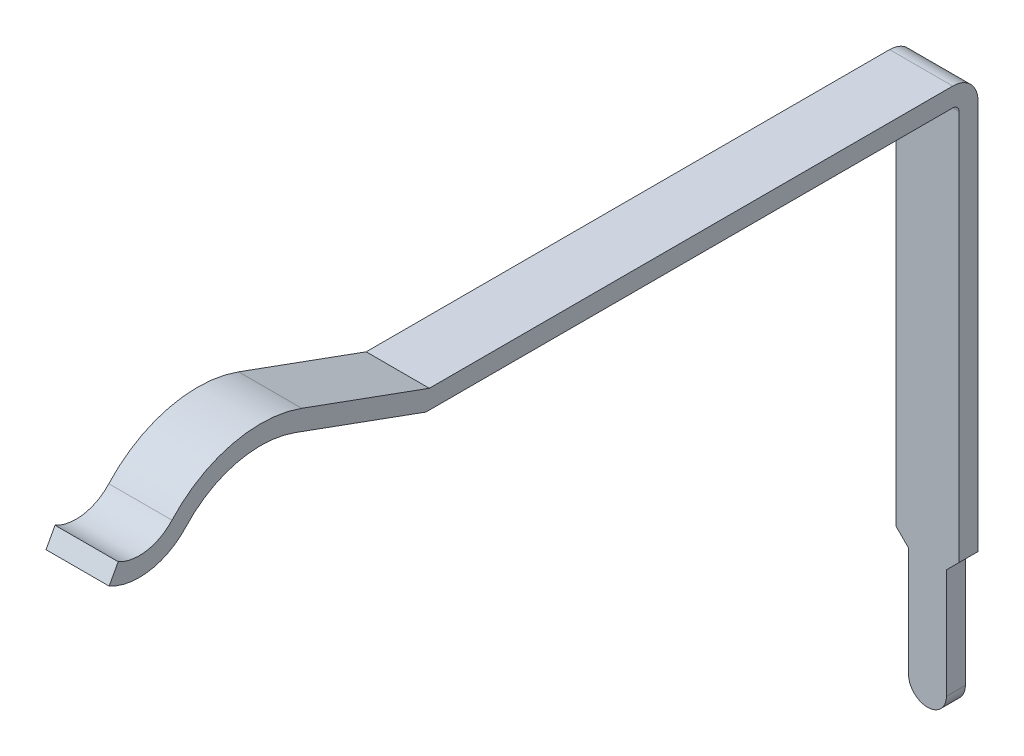
ISO-10303-21;
HEADER;
FILE_DESCRIPTION(('STEP AP214'),'2;1');
FILE_NAME('part.step','',(''),(''),'','','');
FILE_SCHEMA(('AUTOMOTIVE_DESIGN { 1 0 10303 214 1 1 1 1 }'));
ENDSEC;
DATA;
#1=APPLICATION_CONTEXT('core data for automotive mechanical design processes');
#2=APPLICATION_PROTOCOL_DEFINITION('international standard','automotive_design',2000,#1);
#3=PRODUCT_CONTEXT('',#1,'mechanical');
#4=PRODUCT('Part','Part','',(#3));
#5=PRODUCT_RELATED_PRODUCT_CATEGORY('part','',(#4));
#6=PRODUCT_DEFINITION_FORMATION('','',#4);
#7=PRODUCT_DEFINITION_CONTEXT('part definition',#1,'design');
#8=PRODUCT_DEFINITION('design','',#6,#7);
#9=PRODUCT_DEFINITION_SHAPE('','',#8);
#10=(LENGTH_UNIT() NAMED_UNIT(*) SI_UNIT(.MILLI.,.METRE.));
#11=(NAMED_UNIT(*) PLANE_ANGLE_UNIT() SI_UNIT($,.RADIAN.));
#12=(NAMED_UNIT(*) SI_UNIT($,.STERADIAN.) SOLID_ANGLE_UNIT());
#13=UNCERTAINTY_MEASURE_WITH_UNIT(LENGTH_MEASURE(1.E-05),#10,'distance_accuracy_value','');
#14=(GEOMETRIC_REPRESENTATION_CONTEXT(3) GLOBAL_UNCERTAINTY_ASSIGNED_CONTEXT((#13)) GLOBAL_UNIT_ASSIGNED_CONTEXT((#10,
#11,#12)) REPRESENTATION_CONTEXT('',''));
#15=CARTESIAN_POINT('',(0.,0.,0.));
#16=DIRECTION('',(0.,0.,1.));
#17=DIRECTION('',(1.,0.,0.));
#18=AXIS2_PLACEMENT_3D('',#15,#16,#17);
#19=CARTESIAN_POINT('',(0.5,-0.1,-14.46));
#20=DIRECTION('',(0.,0.,-1.));
#21=DIRECTION('',(-1.,0.,0.));
#22=AXIS2_PLACEMENT_3D('',#19,#20,#21);
#23=PLANE('',#22);
#24=DIRECTION('',(0.,1.,0.));
#25=VECTOR('',#24,1.);
#26=CARTESIAN_POINT('',(0.3,-0.1,-14.46));
#27=LINE('',#26,#25);
#28=CARTESIAN_POINT('',(0.3,-8.22,-14.46));
#29=VERTEX_POINT('',#28);
#30=CARTESIAN_POINT('',(0.3,-6.48526500902805,-14.46));
#31=VERTEX_POINT('',#30);
#32=EDGE_CURVE('E276',#29,#31,#27,.T.);
#33=ORIENTED_EDGE('',*,*,#32,.T.);
#34=DIRECTION('',(0.707106781186563,0.707106781186532,0.));
#35=VECTOR('',#34,1.);
#36=CARTESIAN_POINT('',(3.59263250451403,-3.19263250451416,-14.46));
#37=LINE('',#36,#35);
#38=CARTESIAN_POINT('',(0.5,-6.28526500902806,-14.46));
#39=VERTEX_POINT('',#38);
#40=EDGE_CURVE('E271',#31,#39,#37,.T.);
#41=ORIENTED_EDGE('',*,*,#40,.T.);
#42=DIRECTION('',(0.,-1.,0.));
#43=VECTOR('',#42,1.);
#44=CARTESIAN_POINT('',(0.5,-0.1,-14.46));
#45=LINE('',#44,#43);
#46=CARTESIAN_POINT('',(0.5,-0.1,-14.46));
#47=VERTEX_POINT('',#46);
#48=EDGE_CURVE('E199',#47,#39,#45,.T.);
#49=ORIENTED_EDGE('',*,*,#48,.F.);
#50=DIRECTION('',(-1.,0.,0.));
#51=VECTOR('',#50,1.);
#52=CARTESIAN_POINT('',(0.5,-0.1,-14.46));
#53=LINE('',#52,#51);
#54=CARTESIAN_POINT('',(-0.5,-0.1,-14.46));
#55=VERTEX_POINT('',#54);
#56=EDGE_CURVE('E162',#47,#55,#53,.T.);
#57=ORIENTED_EDGE('',*,*,#56,.T.);
#58=DIRECTION('',(0.,-1.,0.));
#59=VECTOR('',#58,1.);
#60=CARTESIAN_POINT('',(-0.5,-0.1,-14.46));
#61=LINE('',#60,#59);
#62=CARTESIAN_POINT('',(-0.5,-6.28526500902805,-14.46));
#63=VERTEX_POINT('',#62);
#64=EDGE_CURVE('E166',#55,#63,#61,.T.);
#65=ORIENTED_EDGE('',*,*,#64,.T.);
#66=DIRECTION('',(0.707106781186542,-0.707106781186553,0.));
#67=VECTOR('',#66,1.);
#68=CARTESIAN_POINT('',(-3.09263250451403,-3.69263250451398,-14.46));
#69=LINE('',#68,#67);
#70=CARTESIAN_POINT('',(-0.3,-6.48526500902805,-14.46));
#71=VERTEX_POINT('',#70);
#72=EDGE_CURVE('E48',#63,#71,#69,.T.);
#73=ORIENTED_EDGE('',*,*,#72,.T.);
#74=DIRECTION('',(0.,-1.,0.));
#75=VECTOR('',#74,1.);
#76=CARTESIAN_POINT('',(-0.3,-0.1,-14.46));
#77=LINE('',#76,#75);
#78=CARTESIAN_POINT('',(-0.3,-8.22,-14.46));
#79=VERTEX_POINT('',#78);
#80=EDGE_CURVE('E278',#71,#79,#77,.T.);
#81=ORIENTED_EDGE('',*,*,#80,.T.);
#82=CARTESIAN_POINT('',(0.,-8.22,-14.46));
#83=DIRECTION('',(0.,0.,-1.));
#84=DIRECTION('',(-1.,0.,0.));
#85=AXIS2_PLACEMENT_3D('',#82,#83,#84);
#86=CIRCLE('',#85,0.3);
#87=EDGE_CURVE('E170',#79,#29,#86,.F.);
#88=ORIENTED_EDGE('',*,*,#87,.T.);
#89=EDGE_LOOP('',(#33,#41,#49,#57,#65,#73,#81,#88));
#90=FACE_BOUND('',#89,.T.);
#91=ADVANCED_FACE('F34',(#90),#23,.F.);
#92=CARTESIAN_POINT('',(0.5,-0.1,-14.76));
#93=DIRECTION('',(0.,0.,-1.));
#94=DIRECTION('',(-1.,0.,0.));
#95=AXIS2_PLACEMENT_3D('',#92,#93,#94);
#96=PLANE('',#95);
#97=DIRECTION('',(-0.707106781186563,-0.707106781186532,0.));
#98=VECTOR('',#97,1.);
#99=CARTESIAN_POINT('',(0.5,-6.28526500902806,-14.76));
#100=LINE('',#99,#98);
#101=CARTESIAN_POINT('',(0.5,-6.28526500902806,-14.76));
#102=VERTEX_POINT('',#101);
#103=CARTESIAN_POINT('',(0.3,-6.48526500902805,-14.76));
#104=VERTEX_POINT('',#103);
#105=EDGE_CURVE('E302',#102,#104,#100,.T.);
#106=ORIENTED_EDGE('',*,*,#105,.T.);
#107=DIRECTION('',(0.,-1.,0.));
#108=VECTOR('',#107,1.);
#109=CARTESIAN_POINT('',(0.3,-6.48526500902805,-14.76));
#110=LINE('',#109,#108);
#111=CARTESIAN_POINT('',(0.3,-8.22,-14.76));
#112=VERTEX_POINT('',#111);
#113=EDGE_CURVE('E288',#104,#112,#110,.T.);
#114=ORIENTED_EDGE('',*,*,#113,.T.);
#115=CARTESIAN_POINT('',(0.,-8.22,-14.76));
#116=DIRECTION('',(0.,0.,-1.));
#117=DIRECTION('',(1.,0.,0.));
#118=AXIS2_PLACEMENT_3D('',#115,#116,#117);
#119=CIRCLE('',#118,0.3);
#120=CARTESIAN_POINT('',(-0.3,-8.22,-14.76));
#121=VERTEX_POINT('',#120);
#122=EDGE_CURVE('E311',#112,#121,#119,.T.);
#123=ORIENTED_EDGE('',*,*,#122,.T.);
#124=DIRECTION('',(0.,1.,0.));
#125=VECTOR('',#124,1.);
#126=CARTESIAN_POINT('',(-0.3,-8.22,-14.76));
#127=LINE('',#126,#125);
#128=CARTESIAN_POINT('',(-0.3,-6.48526500902805,-14.76));
#129=VERTEX_POINT('',#128);
#130=EDGE_CURVE('E308',#121,#129,#127,.T.);
#131=ORIENTED_EDGE('',*,*,#130,.T.);
#132=DIRECTION('',(-0.707106781186542,0.707106781186553,0.));
#133=VECTOR('',#132,1.);
#134=CARTESIAN_POINT('',(-0.3,-6.48526500902805,-14.76));
#135=LINE('',#134,#133);
#136=CARTESIAN_POINT('',(-0.5,-6.28526500902805,-14.76));
#137=VERTEX_POINT('',#136);
#138=EDGE_CURVE('E305',#129,#137,#135,.T.);
#139=ORIENTED_EDGE('',*,*,#138,.T.);
#140=DIRECTION('',(0.,1.,0.));
#141=VECTOR('',#140,1.);
#142=CARTESIAN_POINT('',(-0.5,-0.1,-14.76));
#143=LINE('',#142,#141);
#144=CARTESIAN_POINT('',(-0.5,-0.1,-14.76));
#145=VERTEX_POINT('',#144);
#146=EDGE_CURVE('E169',#145,#137,#143,.F.);
#147=ORIENTED_EDGE('',*,*,#146,.F.);
#148=DIRECTION('',(-1.,0.,0.));
#149=VECTOR('',#148,1.);
#150=CARTESIAN_POINT('',(0.5,-0.1,-14.76));
#151=LINE('',#150,#149);
#152=CARTESIAN_POINT('',(0.5,-0.1,-14.76));
#153=VERTEX_POINT('',#152);
#154=EDGE_CURVE('E11',#153,#145,#151,.T.);
#155=ORIENTED_EDGE('',*,*,#154,.F.);
#156=DIRECTION('',(0.,1.,0.));
#157=VECTOR('',#156,1.);
#158=CARTESIAN_POINT('',(0.5,-0.1,-14.76));
#159=LINE('',#158,#157);
#160=EDGE_CURVE('E241',#153,#102,#159,.F.);
#161=ORIENTED_EDGE('',*,*,#160,.T.);
#162=EDGE_LOOP('',(#106,#114,#123,#131,#139,#147,#155,#161));
#163=FACE_BOUND('',#162,.T.);
#164=ADVANCED_FACE('F315',(#163),#96,.T.);
#165=CARTESIAN_POINT('',(0.5,-0.1,-14.36));
#166=DIRECTION('',(-1.,0.,0.));
#167=DIRECTION('',(0.,0.,1.));
#168=AXIS2_PLACEMENT_3D('',#165,#166,#167);
#169=CYLINDRICAL_SURFACE('',#168,0.4);
#170=CARTESIAN_POINT('',(-0.5,-0.1,-14.36));
#171=DIRECTION('',(1.,0.,0.));
#172=DIRECTION('',(0.,0.,-1.));
#173=AXIS2_PLACEMENT_3D('',#170,#171,#172);
#174=CIRCLE('',#173,0.4);
#175=CARTESIAN_POINT('',(-0.5,0.3,-14.36));
#176=VERTEX_POINT('',#175);
#177=EDGE_CURVE('E173',#176,#145,#174,.F.);
#178=ORIENTED_EDGE('',*,*,#177,.F.);
#179=DIRECTION('',(-1.,0.,0.));
#180=VECTOR('',#179,1.);
#181=CARTESIAN_POINT('',(0.5,0.3,-14.36));
#182=LINE('',#181,#180);
#183=CARTESIAN_POINT('',(0.5,0.3,-14.36));
#184=VERTEX_POINT('',#183);
#185=EDGE_CURVE('E41',#184,#176,#182,.T.);
#186=ORIENTED_EDGE('',*,*,#185,.F.);
#187=CARTESIAN_POINT('',(0.5,-0.1,-14.36));
#188=DIRECTION('',(1.,0.,0.));
#189=DIRECTION('',(0.,0.,-1.));
#190=AXIS2_PLACEMENT_3D('',#187,#188,#189);
#191=CIRCLE('',#190,0.4);
#192=EDGE_CURVE('E237',#184,#153,#191,.F.);
#193=ORIENTED_EDGE('',*,*,#192,.T.);
#194=ORIENTED_EDGE('',*,*,#154,.T.);
#195=EDGE_LOOP('',(#178,#186,#193,#194));
#196=FACE_BOUND('',#195,.T.);
#197=ADVANCED_FACE('F225',(#196),#169,.T.);
#198=CARTESIAN_POINT('',(0.5,0.3,-6.01747897567001));
#199=DIRECTION('',(0.,1.,0.));
#200=DIRECTION('',(0.,0.,1.));
#201=AXIS2_PLACEMENT_3D('',#198,#199,#200);
#202=PLANE('',#201);
#203=DIRECTION('',(0.,0.,-1.));
#204=VECTOR('',#203,1.);
#205=CARTESIAN_POINT('',(-0.5,0.3,-6.01747897567001));
#206=LINE('',#205,#204);
#207=CARTESIAN_POINT('',(-0.5,0.3,-6.07037706988255));
#208=VERTEX_POINT('',#207);
#209=EDGE_CURVE('E176',#208,#176,#206,.T.);
#210=ORIENTED_EDGE('',*,*,#209,.F.);
#211=DIRECTION('',(-1.,0.,0.));
#212=VECTOR('',#211,1.);
#213=CARTESIAN_POINT('',(0.5,0.3,-6.07037706988255));
#214=LINE('',#213,#212);
#215=CARTESIAN_POINT('',(0.5,0.3,-6.07037706988255));
#216=VERTEX_POINT('',#215);
#217=EDGE_CURVE('E214',#216,#208,#214,.T.);
#218=ORIENTED_EDGE('',*,*,#217,.F.);
#219=DIRECTION('',(0.,0.,-1.));
#220=VECTOR('',#219,1.);
#221=CARTESIAN_POINT('',(0.5,0.3,-6.01747897567001));
#222=LINE('',#221,#220);
#223=EDGE_CURVE('E221',#216,#184,#222,.T.);
#224=ORIENTED_EDGE('',*,*,#223,.T.);
#225=ORIENTED_EDGE('',*,*,#185,.T.);
#226=EDGE_LOOP('',(#210,#218,#224,#225));
#227=FACE_BOUND('',#226,.T.);
#228=ADVANCED_FACE('F219',(#227),#202,.T.);
#229=CARTESIAN_POINT('',(0.5,1.03541597949323,-4.04983827231876));
#230=DIRECTION('',(0.,0.93969262078591,-0.342020143325664));
#231=DIRECTION('',(0.,0.342020143325664,0.93969262078591));
#232=AXIS2_PLACEMENT_3D('',#229,#230,#231);
#233=PLANE('',#232);
#234=DIRECTION('',(0.,-0.342020143325664,-0.93969262078591));
#235=VECTOR('',#234,1.);
#236=CARTESIAN_POINT('',(-0.5,1.03541597949323,-4.04983827231876));
#237=LINE('',#236,#235);
#238=CARTESIAN_POINT('',(-0.5,1.03541597949323,-4.04983827231876));
#239=VERTEX_POINT('',#238);
#240=EDGE_CURVE('E179',#239,#208,#237,.T.);
#241=ORIENTED_EDGE('',*,*,#240,.F.);
#242=DIRECTION('',(-1.,0.,0.));
#243=VECTOR('',#242,1.);
#244=CARTESIAN_POINT('',(0.5,1.03541597949323,-4.04983827231876));
#245=LINE('',#244,#243);
#246=CARTESIAN_POINT('',(0.5,1.03541597949323,-4.04983827231876));
#247=VERTEX_POINT('',#246);
#248=EDGE_CURVE('E212',#247,#239,#245,.T.);
#249=ORIENTED_EDGE('',*,*,#248,.F.);
#250=DIRECTION('',(0.,-0.342020143325664,-0.93969262078591));
#251=VECTOR('',#250,1.);
#252=CARTESIAN_POINT('',(0.5,1.03541597949323,-4.04983827231876));
#253=LINE('',#252,#251);
#254=EDGE_CURVE('E234',#247,#216,#253,.T.);
#255=ORIENTED_EDGE('',*,*,#254,.T.);
#256=ORIENTED_EDGE('',*,*,#217,.T.);
#257=EDGE_LOOP('',(#241,#249,#255,#256));
#258=FACE_BOUND('',#257,.T.);
#259=ADVANCED_FACE('F231',(#258),#233,.T.);
#260=CARTESIAN_POINT('',(0.5,-0.750000000000001,-3.4));
#261=DIRECTION('',(-1.,0.,0.));
#262=DIRECTION('',(0.,0.,1.));
#263=AXIS2_PLACEMENT_3D('',#260,#261,#262);
#264=CYLINDRICAL_SURFACE('',#263,1.9);
#265=CARTESIAN_POINT('',(-0.5,-0.750000000000001,-3.4));
#266=DIRECTION('',(1.,0.,0.));
#267=DIRECTION('',(0.,0.,-1.));
#268=AXIS2_PLACEMENT_3D('',#265,#266,#267);
#269=CIRCLE('',#268,1.9);
#270=CARTESIAN_POINT('',(-0.5,0.528846153846154,-1.99481228485554));
#271=VERTEX_POINT('',#270);
#272=EDGE_CURVE('E182',#271,#239,#269,.F.);
#273=ORIENTED_EDGE('',*,*,#272,.F.);
#274=DIRECTION('',(-1.,0.,0.));
#275=VECTOR('',#274,1.);
#276=CARTESIAN_POINT('',(0.5,0.528846153846154,-1.99481228485554));
#277=LINE('',#276,#275);
#278=CARTESIAN_POINT('',(0.5,0.528846153846154,-1.99481228485554));
#279=VERTEX_POINT('',#278);
#280=EDGE_CURVE('E210',#279,#271,#277,.T.);
#281=ORIENTED_EDGE('',*,*,#280,.F.);
#282=CARTESIAN_POINT('',(0.5,-0.750000000000001,-3.4));
#283=DIRECTION('',(1.,0.,0.));
#284=DIRECTION('',(0.,0.,-1.));
#285=AXIS2_PLACEMENT_3D('',#282,#283,#284);
#286=CIRCLE('',#285,1.9);
#287=EDGE_CURVE('E239',#279,#247,#286,.F.);
#288=ORIENTED_EDGE('',*,*,#287,.T.);
#289=ORIENTED_EDGE('',*,*,#248,.T.);
#290=EDGE_LOOP('',(#273,#281,#288,#289));
#291=FACE_BOUND('',#290,.T.);
#292=ADVANCED_FACE('F373',(#291),#264,.T.);
#293=CARTESIAN_POINT('',(0.5,1.,-1.47711154769706));
#294=DIRECTION('',(-1.,0.,0.));
#295=DIRECTION('',(0.,0.,1.));
#296=AXIS2_PLACEMENT_3D('',#293,#294,#295);
#297=CYLINDRICAL_SURFACE('',#296,0.7);
#298=CARTESIAN_POINT('',(-0.5,1.,-1.47711154769706));
#299=DIRECTION('',(1.,0.,0.));
#300=DIRECTION('',(0.,0.,-1.));
#301=AXIS2_PLACEMENT_3D('',#298,#299,#300);
#302=CIRCLE('',#301,0.7);
#303=CARTESIAN_POINT('',(-0.5,0.384810078255083,-1.14313346430912));
#304=VERTEX_POINT('',#303);
#305=EDGE_CURVE('E185',#304,#271,#302,.T.);
#306=ORIENTED_EDGE('',*,*,#305,.F.);
#307=DIRECTION('',(-1.,0.,0.));
#308=VECTOR('',#307,1.);
#309=CARTESIAN_POINT('',(0.5,0.384810078255083,-1.14313346430912));
#310=LINE('',#309,#308);
#311=CARTESIAN_POINT('',(0.5,0.384810078255083,-1.14313346430912));
#312=VERTEX_POINT('',#311);
#313=EDGE_CURVE('E208',#312,#304,#310,.T.);
#314=ORIENTED_EDGE('',*,*,#313,.F.);
#315=CARTESIAN_POINT('',(0.5,1.,-1.47711154769706));
#316=DIRECTION('',(1.,0.,0.));
#317=DIRECTION('',(0.,0.,-1.));
#318=AXIS2_PLACEMENT_3D('',#315,#316,#317);
#319=CIRCLE('',#318,0.7);
#320=EDGE_CURVE('E246',#312,#279,#319,.T.);
#321=ORIENTED_EDGE('',*,*,#320,.T.);
#322=ORIENTED_EDGE('',*,*,#280,.T.);
#323=EDGE_LOOP('',(#306,#314,#321,#322));
#324=FACE_BOUND('',#323,.T.);
#325=ADVANCED_FACE('F376',(#324),#297,.F.);
#326=CARTESIAN_POINT('',(0.5,0.121157254650118,-1.));
#327=DIRECTION('',(0.,0.477111547697058,0.878842745349882));
#328=DIRECTION('',(0.,-0.878842745349882,0.477111547697058));
#329=AXIS2_PLACEMENT_3D('',#326,#327,#328);
#330=PLANE('',#329);
#331=DIRECTION('',(0.,0.878842745349882,-0.477111547697058));
#332=VECTOR('',#331,1.);
#333=CARTESIAN_POINT('',(-0.5,0.121157254650118,-1.));
#334=LINE('',#333,#332);
#335=CARTESIAN_POINT('',(-0.5,0.121157254650118,-1.));
#336=VERTEX_POINT('',#335);
#337=EDGE_CURVE('E188',#336,#304,#334,.T.);
#338=ORIENTED_EDGE('',*,*,#337,.F.);
#339=DIRECTION('',(-1.,0.,0.));
#340=VECTOR('',#339,1.);
#341=CARTESIAN_POINT('',(0.5,0.121157254650118,-1.));
#342=LINE('',#341,#340);
#343=CARTESIAN_POINT('',(0.5,0.121157254650118,-1.));
#344=VERTEX_POINT('',#343);
#345=EDGE_CURVE('E206',#344,#336,#342,.T.);
#346=ORIENTED_EDGE('',*,*,#345,.F.);
#347=DIRECTION('',(0.,0.878842745349882,-0.477111547697058));
#348=VECTOR('',#347,1.);
#349=CARTESIAN_POINT('',(0.5,0.121157254650118,-1.));
#350=LINE('',#349,#348);
#351=EDGE_CURVE('E249',#344,#312,#350,.T.);
#352=ORIENTED_EDGE('',*,*,#351,.T.);
#353=ORIENTED_EDGE('',*,*,#313,.T.);
#354=EDGE_LOOP('',(#338,#346,#352,#353));
#355=FACE_BOUND('',#354,.T.);
#356=ADVANCED_FACE('F380',(#355),#330,.T.);
#357=CARTESIAN_POINT('',(0.5,1.,-1.47711154769706));
#358=DIRECTION('',(-1.,0.,0.));
#359=DIRECTION('',(0.,0.,1.));
#360=AXIS2_PLACEMENT_3D('',#357,#358,#359);
#361=CYLINDRICAL_SURFACE('',#360,1.);
#362=CARTESIAN_POINT('',(-0.5,1.,-1.47711154769706));
#363=DIRECTION('',(1.,0.,0.));
#364=DIRECTION('',(0.,0.,1.));
#365=AXIS2_PLACEMENT_3D('',#362,#363,#364);
#366=CIRCLE('',#365,1.);
#367=CARTESIAN_POINT('',(-0.5,0.326923076923077,-2.21668402935204));
#368=VERTEX_POINT('',#367);
#369=EDGE_CURVE('E191',#336,#368,#366,.T.);
#370=ORIENTED_EDGE('',*,*,#369,.T.);
#371=DIRECTION('',(-1.,0.,0.));
#372=VECTOR('',#371,1.);
#373=CARTESIAN_POINT('',(0.5,0.326923076923077,-2.21668402935204));
#374=LINE('',#373,#372);
#375=CARTESIAN_POINT('',(0.5,0.326923076923077,-2.21668402935204));
#376=VERTEX_POINT('',#375);
#377=EDGE_CURVE('E203',#376,#368,#374,.T.);
#378=ORIENTED_EDGE('',*,*,#377,.F.);
#379=CARTESIAN_POINT('',(0.5,1.,-1.47711154769706));
#380=DIRECTION('',(1.,0.,0.));
#381=DIRECTION('',(0.,0.,1.));
#382=AXIS2_PLACEMENT_3D('',#379,#380,#381);
#383=CIRCLE('',#382,1.);
#384=EDGE_CURVE('E252',#344,#376,#383,.T.);
#385=ORIENTED_EDGE('',*,*,#384,.F.);
#386=ORIENTED_EDGE('',*,*,#345,.T.);
#387=EDGE_LOOP('',(#370,#378,#385,#386));
#388=FACE_BOUND('',#387,.T.);
#389=ADVANCED_FACE('F258',(#388),#361,.T.);
#390=CARTESIAN_POINT('',(0.5,-0.750000000000001,-3.4));
#391=DIRECTION('',(-1.,0.,0.));
#392=DIRECTION('',(0.,0.,1.));
#393=AXIS2_PLACEMENT_3D('',#390,#391,#392);
#394=CYLINDRICAL_SURFACE('',#393,1.6);
#395=CARTESIAN_POINT('',(-0.5,-0.750000000000001,-3.4));
#396=DIRECTION('',(-1.,0.,0.));
#397=DIRECTION('',(0.,0.,-1.));
#398=AXIS2_PLACEMENT_3D('',#395,#396,#397);
#399=CIRCLE('',#398,1.6);
#400=CARTESIAN_POINT('',(-0.5,0.753508193257457,-3.94723222932106));
#401=VERTEX_POINT('',#400);
#402=EDGE_CURVE('E193',#368,#401,#399,.T.);
#403=ORIENTED_EDGE('',*,*,#402,.T.);
#404=DIRECTION('',(-1.,0.,0.));
#405=VECTOR('',#404,1.);
#406=CARTESIAN_POINT('',(0.5,0.753508193257457,-3.94723222932106));
#407=LINE('',#406,#405);
#408=CARTESIAN_POINT('',(0.5,0.753508193257457,-3.94723222932106));
#409=VERTEX_POINT('',#408);
#410=EDGE_CURVE('E157',#409,#401,#407,.T.);
#411=ORIENTED_EDGE('',*,*,#410,.F.);
#412=CARTESIAN_POINT('',(0.5,-0.750000000000001,-3.4));
#413=DIRECTION('',(-1.,0.,0.));
#414=DIRECTION('',(0.,0.,-1.));
#415=AXIS2_PLACEMENT_3D('',#412,#413,#414);
#416=CIRCLE('',#415,1.6);
#417=EDGE_CURVE('E145',#376,#409,#416,.T.);
#418=ORIENTED_EDGE('',*,*,#417,.F.);
#419=ORIENTED_EDGE('',*,*,#377,.T.);
#420=EDGE_LOOP('',(#403,#411,#418,#419));
#421=FACE_BOUND('',#420,.T.);
#422=ADVANCED_FACE('F262',(#421),#394,.F.);
#423=CARTESIAN_POINT('',(0.5,0.753508193257457,-3.94723222932106));
#424=DIRECTION('',(0.,0.93969262078591,-0.342020143325664));
#425=DIRECTION('',(0.,0.342020143325664,0.93969262078591));
#426=AXIS2_PLACEMENT_3D('',#423,#424,#425);
#427=PLANE('',#426);
#428=DIRECTION('',(0.,-0.342020143325664,-0.93969262078591));
#429=VECTOR('',#428,1.);
#430=CARTESIAN_POINT('',(-0.5,0.753508193257457,-3.94723222932106));
#431=LINE('',#430,#429);
#432=CARTESIAN_POINT('',(-0.5,0.,-6.01747897567001));
#433=VERTEX_POINT('',#432);
#434=EDGE_CURVE('E154',#401,#433,#431,.T.);
#435=ORIENTED_EDGE('',*,*,#434,.T.);
#436=DIRECTION('',(-1.,0.,0.));
#437=VECTOR('',#436,1.);
#438=CARTESIAN_POINT('',(0.5,0.,-6.01747897567001));
#439=LINE('',#438,#437);
#440=CARTESIAN_POINT('',(0.5,0.,-6.01747897567001));
#441=VERTEX_POINT('',#440);
#442=EDGE_CURVE('E151',#441,#433,#439,.T.);
#443=ORIENTED_EDGE('',*,*,#442,.F.);
#444=DIRECTION('',(0.,-0.342020143325664,-0.93969262078591));
#445=VECTOR('',#444,1.);
#446=CARTESIAN_POINT('',(0.5,0.753508193257457,-3.94723222932106));
#447=LINE('',#446,#445);
#448=EDGE_CURVE('E137',#409,#441,#447,.T.);
#449=ORIENTED_EDGE('',*,*,#448,.F.);
#450=ORIENTED_EDGE('',*,*,#410,.T.);
#451=EDGE_LOOP('',(#435,#443,#449,#450));
#452=FACE_BOUND('',#451,.T.);
#453=ADVANCED_FACE('F152',(#452),#427,.F.);
#454=CARTESIAN_POINT('',(0.5,0.,-6.01747897567001));
#455=DIRECTION('',(0.,1.,0.));
#456=DIRECTION('',(0.,0.,1.));
#457=AXIS2_PLACEMENT_3D('',#454,#455,#456);
#458=PLANE('',#457);
#459=DIRECTION('',(0.,0.,-1.));
#460=VECTOR('',#459,1.);
#461=CARTESIAN_POINT('',(-0.5,0.,-6.01747897567001));
#462=LINE('',#461,#460);
#463=CARTESIAN_POINT('',(-0.5,0.,-14.36));
#464=VERTEX_POINT('',#463);
#465=EDGE_CURVE('E196',#433,#464,#462,.T.);
#466=ORIENTED_EDGE('',*,*,#465,.T.);
#467=DIRECTION('',(-1.,0.,0.));
#468=VECTOR('',#467,1.);
#469=CARTESIAN_POINT('',(0.5,0.,-14.36));
#470=LINE('',#469,#468);
#471=CARTESIAN_POINT('',(0.5,0.,-14.36));
#472=VERTEX_POINT('',#471);
#473=EDGE_CURVE('E158',#472,#464,#470,.T.);
#474=ORIENTED_EDGE('',*,*,#473,.F.);
#475=DIRECTION('',(0.,0.,-1.));
#476=VECTOR('',#475,1.);
#477=CARTESIAN_POINT('',(0.5,0.,-6.01747897567001));
#478=LINE('',#477,#476);
#479=EDGE_CURVE('E142',#441,#472,#478,.T.);
#480=ORIENTED_EDGE('',*,*,#479,.F.);
#481=ORIENTED_EDGE('',*,*,#442,.T.);
#482=EDGE_LOOP('',(#466,#474,#480,#481));
#483=FACE_BOUND('',#482,.T.);
#484=ADVANCED_FACE('F160',(#483),#458,.F.);
#485=CARTESIAN_POINT('',(0.5,-0.1,-14.36));
#486=DIRECTION('',(-1.,0.,0.));
#487=DIRECTION('',(0.,0.,1.));
#488=AXIS2_PLACEMENT_3D('',#485,#486,#487);
#489=CYLINDRICAL_SURFACE('',#488,0.0999999999999997);
#490=CARTESIAN_POINT('',(-0.5,-0.1,-14.36));
#491=DIRECTION('',(-1.,0.,0.));
#492=DIRECTION('',(0.,0.,1.));
#493=AXIS2_PLACEMENT_3D('',#490,#491,#492);
#494=CIRCLE('',#493,0.0999999999999997);
#495=EDGE_CURVE('E101',#464,#55,#494,.T.);
#496=ORIENTED_EDGE('',*,*,#495,.T.);
#497=ORIENTED_EDGE('',*,*,#56,.F.);
#498=CARTESIAN_POINT('',(0.5,-0.1,-14.36));
#499=DIRECTION('',(-1.,0.,0.));
#500=DIRECTION('',(0.,0.,1.));
#501=AXIS2_PLACEMENT_3D('',#498,#499,#500);
#502=CIRCLE('',#501,0.0999999999999997);
#503=EDGE_CURVE('E57',#472,#47,#502,.T.);
#504=ORIENTED_EDGE('',*,*,#503,.F.);
#505=ORIENTED_EDGE('',*,*,#473,.T.);
#506=EDGE_LOOP('',(#496,#497,#504,#505));
#507=FACE_BOUND('',#506,.T.);
#508=ADVANCED_FACE('F264',(#507),#489,.F.);
#509=CARTESIAN_POINT('',(0.5,-0.1,-14.36));
#510=DIRECTION('',(1.,0.,0.));
#511=DIRECTION('',(0.,0.,-1.));
#512=AXIS2_PLACEMENT_3D('',#509,#510,#511);
#513=PLANE('',#512);
#514=DIRECTION('',(0.,0.,1.));
#515=VECTOR('',#514,1.);
#516=CARTESIAN_POINT('',(0.5,-6.28526500902806,-14.76));
#517=LINE('',#516,#515);
#518=EDGE_CURVE('E292',#102,#39,#517,.T.);
#519=ORIENTED_EDGE('',*,*,#518,.F.);
#520=ORIENTED_EDGE('',*,*,#160,.F.);
#521=ORIENTED_EDGE('',*,*,#192,.F.);
#522=ORIENTED_EDGE('',*,*,#223,.F.);
#523=ORIENTED_EDGE('',*,*,#254,.F.);
#524=ORIENTED_EDGE('',*,*,#287,.F.);
#525=ORIENTED_EDGE('',*,*,#320,.F.);
#526=ORIENTED_EDGE('',*,*,#351,.F.);
#527=ORIENTED_EDGE('',*,*,#384,.T.);
#528=ORIENTED_EDGE('',*,*,#417,.T.);
#529=ORIENTED_EDGE('',*,*,#448,.T.);
#530=ORIENTED_EDGE('',*,*,#479,.T.);
#531=ORIENTED_EDGE('',*,*,#503,.T.);
#532=ORIENTED_EDGE('',*,*,#48,.T.);
#533=EDGE_LOOP('',(#519,#520,#521,#522,#523,#524,#525,#526,#527,#528,#529,#530,#531,#532));
#534=FACE_BOUND('',#533,.T.);
#535=ADVANCED_FACE('F140',(#534),#513,.T.);
#536=CARTESIAN_POINT('',(-0.5,-0.1,-14.36));
#537=DIRECTION('',(1.,0.,0.));
#538=DIRECTION('',(0.,0.,-1.));
#539=AXIS2_PLACEMENT_3D('',#536,#537,#538);
#540=PLANE('',#539);
#541=ORIENTED_EDGE('',*,*,#146,.T.);
#542=DIRECTION('',(0.,0.,1.));
#543=VECTOR('',#542,1.);
#544=CARTESIAN_POINT('',(-0.5,-6.28526500902805,-14.76));
#545=LINE('',#544,#543);
#546=EDGE_CURVE('E290',#137,#63,#545,.T.);
#547=ORIENTED_EDGE('',*,*,#546,.T.);
#548=ORIENTED_EDGE('',*,*,#64,.F.);
#549=ORIENTED_EDGE('',*,*,#495,.F.);
#550=ORIENTED_EDGE('',*,*,#465,.F.);
#551=ORIENTED_EDGE('',*,*,#434,.F.);
#552=ORIENTED_EDGE('',*,*,#402,.F.);
#553=ORIENTED_EDGE('',*,*,#369,.F.);
#554=ORIENTED_EDGE('',*,*,#337,.T.);
#555=ORIENTED_EDGE('',*,*,#305,.T.);
#556=ORIENTED_EDGE('',*,*,#272,.T.);
#557=ORIENTED_EDGE('',*,*,#240,.T.);
#558=ORIENTED_EDGE('',*,*,#209,.T.);
#559=ORIENTED_EDGE('',*,*,#177,.T.);
#560=EDGE_LOOP('',(#541,#547,#548,#549,#550,#551,#552,#553,#554,#555,#556,#557,#558,#559));
#561=FACE_BOUND('',#560,.T.);
#562=ADVANCED_FACE('F227',(#561),#540,.F.);
#563=CARTESIAN_POINT('',(0.,-8.22,-14.76));
#564=DIRECTION('',(0.,0.,1.));
#565=DIRECTION('',(1.,0.,0.));
#566=AXIS2_PLACEMENT_3D('',#563,#564,#565);
#567=CYLINDRICAL_SURFACE('',#566,0.3);
#568=DIRECTION('',(0.,0.,1.));
#569=VECTOR('',#568,1.);
#570=CARTESIAN_POINT('',(-0.3,-8.22,-14.76));
#571=LINE('',#570,#569);
#572=EDGE_CURVE('E284',#121,#79,#571,.T.);
#573=ORIENTED_EDGE('',*,*,#572,.F.);
#574=ORIENTED_EDGE('',*,*,#122,.F.);
#575=DIRECTION('',(0.,0.,1.));
#576=VECTOR('',#575,1.);
#577=CARTESIAN_POINT('',(0.3,-8.22,-14.76));
#578=LINE('',#577,#576);
#579=EDGE_CURVE('E283',#112,#29,#578,.T.);
#580=ORIENTED_EDGE('',*,*,#579,.T.);
#581=ORIENTED_EDGE('',*,*,#87,.F.);
#582=EDGE_LOOP('',(#573,#574,#580,#581));
#583=FACE_BOUND('',#582,.T.);
#584=ADVANCED_FACE('F324',(#583),#567,.T.);
#585=CARTESIAN_POINT('',(0.3,-6.48526500902805,-14.76));
#586=DIRECTION('',(-1.,0.,0.));
#587=DIRECTION('',(0.,-1.,0.));
#588=AXIS2_PLACEMENT_3D('',#585,#586,#587);
#589=PLANE('',#588);
#590=ORIENTED_EDGE('',*,*,#579,.F.);
#591=ORIENTED_EDGE('',*,*,#113,.F.);
#592=DIRECTION('',(0.,0.,1.));
#593=VECTOR('',#592,1.);
#594=CARTESIAN_POINT('',(0.3,-6.48526500902805,-14.76));
#595=LINE('',#594,#593);
#596=EDGE_CURVE('E295',#104,#31,#595,.T.);
#597=ORIENTED_EDGE('',*,*,#596,.T.);
#598=ORIENTED_EDGE('',*,*,#32,.F.);
#599=EDGE_LOOP('',(#590,#591,#597,#598));
#600=FACE_BOUND('',#599,.T.);
#601=ADVANCED_FACE('F331',(#600),#589,.F.);
#602=CARTESIAN_POINT('',(-0.3,-8.22,-14.76));
#603=DIRECTION('',(1.,0.,0.));
#604=DIRECTION('',(0.,0.,-1.));
#605=AXIS2_PLACEMENT_3D('',#602,#603,#604);
#606=PLANE('',#605);
#607=DIRECTION('',(0.,0.,1.));
#608=VECTOR('',#607,1.);
#609=CARTESIAN_POINT('',(-0.3,-6.48526500902805,-14.76));
#610=LINE('',#609,#608);
#611=EDGE_CURVE('E287',#129,#71,#610,.T.);
#612=ORIENTED_EDGE('',*,*,#611,.F.);
#613=ORIENTED_EDGE('',*,*,#130,.F.);
#614=ORIENTED_EDGE('',*,*,#572,.T.);
#615=ORIENTED_EDGE('',*,*,#80,.F.);
#616=EDGE_LOOP('',(#612,#613,#614,#615));
#617=FACE_BOUND('',#616,.T.);
#618=ADVANCED_FACE('F350',(#617),#606,.F.);
#619=CARTESIAN_POINT('',(0.5,-6.28526500902806,-14.76));
#620=DIRECTION('',(-0.707106781186532,0.707106781186563,0.));
#621=DIRECTION('',(-0.707106781186563,-0.707106781186532,0.));
#622=AXIS2_PLACEMENT_3D('',#619,#620,#621);
#623=PLANE('',#622);
#624=ORIENTED_EDGE('',*,*,#596,.F.);
#625=ORIENTED_EDGE('',*,*,#105,.F.);
#626=ORIENTED_EDGE('',*,*,#518,.T.);
#627=ORIENTED_EDGE('',*,*,#40,.F.);
#628=EDGE_LOOP('',(#624,#625,#626,#627));
#629=FACE_BOUND('',#628,.T.);
#630=ADVANCED_FACE('F353',(#629),#623,.F.);
#631=CARTESIAN_POINT('',(-0.3,-6.48526500902805,-14.76));
#632=DIRECTION('',(0.707106781186553,0.707106781186542,0.));
#633=DIRECTION('',(-0.707106781186542,0.707106781186553,0.));
#634=AXIS2_PLACEMENT_3D('',#631,#632,#633);
#635=PLANE('',#634);
#636=ORIENTED_EDGE('',*,*,#546,.F.);
#637=ORIENTED_EDGE('',*,*,#138,.F.);
#638=ORIENTED_EDGE('',*,*,#611,.T.);
#639=ORIENTED_EDGE('',*,*,#72,.F.);
#640=EDGE_LOOP('',(#636,#637,#638,#639));
#641=FACE_BOUND('',#640,.T.);
#642=ADVANCED_FACE('F351',(#641),#635,.F.);
#643=CLOSED_SHELL('',(#91,#164,#197,#228,#259,#292,#325,#356,#389,#422,#453,#484,#508,#535,#562,
#584,#601,#618,#630,#642));
#644=MANIFOLD_SOLID_BREP('B2',#643);
#645=ADVANCED_BREP_SHAPE_REPRESENTATION('',(#18,#644),#14);
#646=SHAPE_DEFINITION_REPRESENTATION(#9,#645);
ENDSEC;
END-ISO-10303-21;
